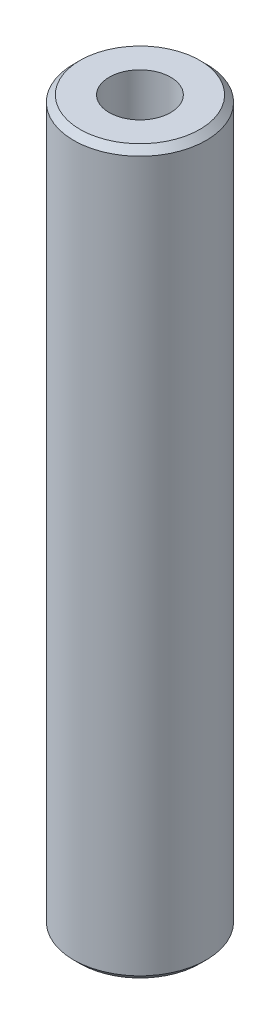
ISO-10303-21;
HEADER;
FILE_DESCRIPTION(('STEP AP214'),'2;1');
FILE_NAME('part.step','',(''),(''),'','','');
FILE_SCHEMA(('AUTOMOTIVE_DESIGN { 1 0 10303 214 1 1 1 1 }'));
ENDSEC;
DATA;
#1=APPLICATION_CONTEXT('core data for automotive mechanical design processes');
#2=APPLICATION_PROTOCOL_DEFINITION('international standard','automotive_design',2000,#1);
#3=PRODUCT_CONTEXT('',#1,'mechanical');
#4=PRODUCT('Part','Part','',(#3));
#5=PRODUCT_RELATED_PRODUCT_CATEGORY('part','',(#4));
#6=PRODUCT_DEFINITION_FORMATION('','',#4);
#7=PRODUCT_DEFINITION_CONTEXT('part definition',#1,'design');
#8=PRODUCT_DEFINITION('design','',#6,#7);
#9=PRODUCT_DEFINITION_SHAPE('','',#8);
#10=(LENGTH_UNIT() NAMED_UNIT(*) SI_UNIT(.MILLI.,.METRE.));
#11=(NAMED_UNIT(*) PLANE_ANGLE_UNIT() SI_UNIT($,.RADIAN.));
#12=(NAMED_UNIT(*) SI_UNIT($,.STERADIAN.) SOLID_ANGLE_UNIT());
#13=UNCERTAINTY_MEASURE_WITH_UNIT(LENGTH_MEASURE(1.E-05),#10,'distance_accuracy_value','');
#14=(GEOMETRIC_REPRESENTATION_CONTEXT(3) GLOBAL_UNCERTAINTY_ASSIGNED_CONTEXT((#13)) GLOBAL_UNIT_ASSIGNED_CONTEXT((#10,
#11,#12)) REPRESENTATION_CONTEXT('',''));
#15=CARTESIAN_POINT('',(0.,0.,0.));
#16=DIRECTION('',(0.,0.,1.));
#17=DIRECTION('',(1.,0.,0.));
#18=AXIS2_PLACEMENT_3D('',#15,#16,#17);
#19=CARTESIAN_POINT('',(0.,600.,0.));
#20=DIRECTION('',(0.,-1.,0.));
#21=DIRECTION('',(0.,0.,-1.));
#22=AXIS2_PLACEMENT_3D('',#19,#20,#21);
#23=CYLINDRICAL_SURFACE('',#22,55.);
#24=CARTESIAN_POINT('',(0.,594.715748784026,0.));
#25=DIRECTION('',(0.,1.,0.));
#26=DIRECTION('',(0.,0.,1.));
#27=AXIS2_PLACEMENT_3D('',#24,#25,#26);
#28=CIRCLE('',#27,55.);
#29=CARTESIAN_POINT('',(0.,594.715748784026,55.));
#30=VERTEX_POINT('',#29);
#31=EDGE_CURVE('E50',#30,#30,#28,.F.);
#32=ORIENTED_EDGE('',*,*,#31,.T.);
#33=EDGE_LOOP('',(#32));
#34=FACE_BOUND('',#33,.T.);
#35=CARTESIAN_POINT('',(0.,5.2842512159742,0.));
#36=DIRECTION('',(0.,1.,0.));
#37=DIRECTION('',(0.,0.,1.));
#38=AXIS2_PLACEMENT_3D('',#35,#36,#37);
#39=CIRCLE('',#38,55.);
#40=CARTESIAN_POINT('',(0.,5.2842512159742,55.));
#41=VERTEX_POINT('',#40);
#42=EDGE_CURVE('E51',#41,#41,#39,.T.);
#43=ORIENTED_EDGE('',*,*,#42,.T.);
#44=EDGE_LOOP('',(#43));
#45=FACE_BOUND('',#44,.T.);
#46=ADVANCED_FACE('F39',(#34,#45),#23,.T.);
#47=CARTESIAN_POINT('',(0.,600.,0.));
#48=DIRECTION('',(0.,1.,0.));
#49=DIRECTION('',(0.,0.,1.));
#50=AXIS2_PLACEMENT_3D('',#47,#48,#49);
#51=PLANE('',#50);
#52=CARTESIAN_POINT('',(0.,600.,0.));
#53=DIRECTION('',(0.,1.,0.));
#54=DIRECTION('',(0.,0.,1.));
#55=AXIS2_PLACEMENT_3D('',#52,#53,#54);
#56=CIRCLE('',#55,49.7157487840256);
#57=CARTESIAN_POINT('',(0.,600.,49.7157487840256));
#58=VERTEX_POINT('',#57);
#59=EDGE_CURVE('E54',#58,#58,#56,.T.);
#60=ORIENTED_EDGE('',*,*,#59,.T.);
#61=EDGE_LOOP('',(#60));
#62=FACE_BOUND('',#61,.T.);
#63=CARTESIAN_POINT('',(0.,600.,0.));
#64=DIRECTION('',(0.,1.,0.));
#65=DIRECTION('',(0.,0.,1.));
#66=AXIS2_PLACEMENT_3D('',#63,#64,#65);
#67=CIRCLE('',#66,25.4993230391702);
#68=CARTESIAN_POINT('',(0.,600.,25.4993230391702));
#69=VERTEX_POINT('',#68);
#70=EDGE_CURVE('E58',#69,#69,#67,.T.);
#71=ORIENTED_EDGE('',*,*,#70,.F.);
#72=EDGE_LOOP('',(#71));
#73=FACE_BOUND('',#72,.T.);
#74=ADVANCED_FACE('F69',(#62,#73),#51,.T.);
#75=CARTESIAN_POINT('',(0.,0.,0.));
#76=DIRECTION('',(0.,1.,0.));
#77=DIRECTION('',(0.,0.,1.));
#78=AXIS2_PLACEMENT_3D('',#75,#76,#77);
#79=PLANE('',#78);
#80=CARTESIAN_POINT('',(0.,0.,0.));
#81=DIRECTION('',(0.,1.,0.));
#82=DIRECTION('',(0.,0.,1.));
#83=AXIS2_PLACEMENT_3D('',#80,#81,#82);
#84=CIRCLE('',#83,49.7157487840258);
#85=CARTESIAN_POINT('',(0.,0.,49.7157487840258));
#86=VERTEX_POINT('',#85);
#87=EDGE_CURVE('E10',#86,#86,#84,.F.);
#88=ORIENTED_EDGE('',*,*,#87,.T.);
#89=EDGE_LOOP('',(#88));
#90=FACE_BOUND('',#89,.T.);
#91=CARTESIAN_POINT('',(0.,0.,0.));
#92=DIRECTION('',(0.,1.,0.));
#93=DIRECTION('',(0.,0.,1.));
#94=AXIS2_PLACEMENT_3D('',#91,#92,#93);
#95=CIRCLE('',#94,25.4993230391702);
#96=CARTESIAN_POINT('',(0.,0.,25.4993230391702));
#97=VERTEX_POINT('',#96);
#98=EDGE_CURVE('E63',#97,#97,#95,.T.);
#99=ORIENTED_EDGE('',*,*,#98,.T.);
#100=EDGE_LOOP('',(#99));
#101=FACE_BOUND('',#100,.T.);
#102=ADVANCED_FACE('F75',(#90,#101),#79,.F.);
#103=CARTESIAN_POINT('',(0.,600.,0.));
#104=DIRECTION('',(0.,-1.,0.));
#105=DIRECTION('',(0.,0.,-1.));
#106=AXIS2_PLACEMENT_3D('',#103,#104,#105);
#107=CYLINDRICAL_SURFACE('',#106,25.4993230391702);
#108=ORIENTED_EDGE('',*,*,#70,.T.);
#109=EDGE_LOOP('',(#108));
#110=FACE_BOUND('',#109,.T.);
#111=ORIENTED_EDGE('',*,*,#98,.F.);
#112=EDGE_LOOP('',(#111));
#113=FACE_BOUND('',#112,.T.);
#114=ADVANCED_FACE('F70',(#110,#113),#107,.F.);
#115=CARTESIAN_POINT('',(0.,600.,0.));
#116=DIRECTION('',(0.,-1.,0.));
#117=DIRECTION('',(0.,0.,-1.));
#118=AXIS2_PLACEMENT_3D('',#115,#116,#117);
#119=CONICAL_SURFACE('',#118,49.7157487840256,0.78539816339745);
#120=ORIENTED_EDGE('',*,*,#31,.F.);
#121=EDGE_LOOP('',(#120));
#122=FACE_BOUND('',#121,.T.);
#123=ORIENTED_EDGE('',*,*,#59,.F.);
#124=EDGE_LOOP('',(#123));
#125=FACE_BOUND('',#124,.T.);
#126=ADVANCED_FACE('F81',(#122,#125),#119,.T.);
#127=CARTESIAN_POINT('',(0.,5.2842512159742,0.));
#128=DIRECTION('',(0.,1.,0.));
#129=DIRECTION('',(0.,0.,1.));
#130=AXIS2_PLACEMENT_3D('',#127,#128,#129);
#131=CONICAL_SURFACE('',#130,55.,0.785398163397449);
#132=ORIENTED_EDGE('',*,*,#87,.F.);
#133=EDGE_LOOP('',(#132));
#134=FACE_BOUND('',#133,.T.);
#135=ORIENTED_EDGE('',*,*,#42,.F.);
#136=EDGE_LOOP('',(#135));
#137=FACE_BOUND('',#136,.T.);
#138=ADVANCED_FACE('F45',(#134,#137),#131,.T.);
#139=CLOSED_SHELL('',(#46,#74,#102,#114,#126,#138));
#140=MANIFOLD_SOLID_BREP('B2',#139);
#141=ADVANCED_BREP_SHAPE_REPRESENTATION('',(#18,#140),#14);
#142=SHAPE_DEFINITION_REPRESENTATION(#9,#141);
ENDSEC;
END-ISO-10303-21;
